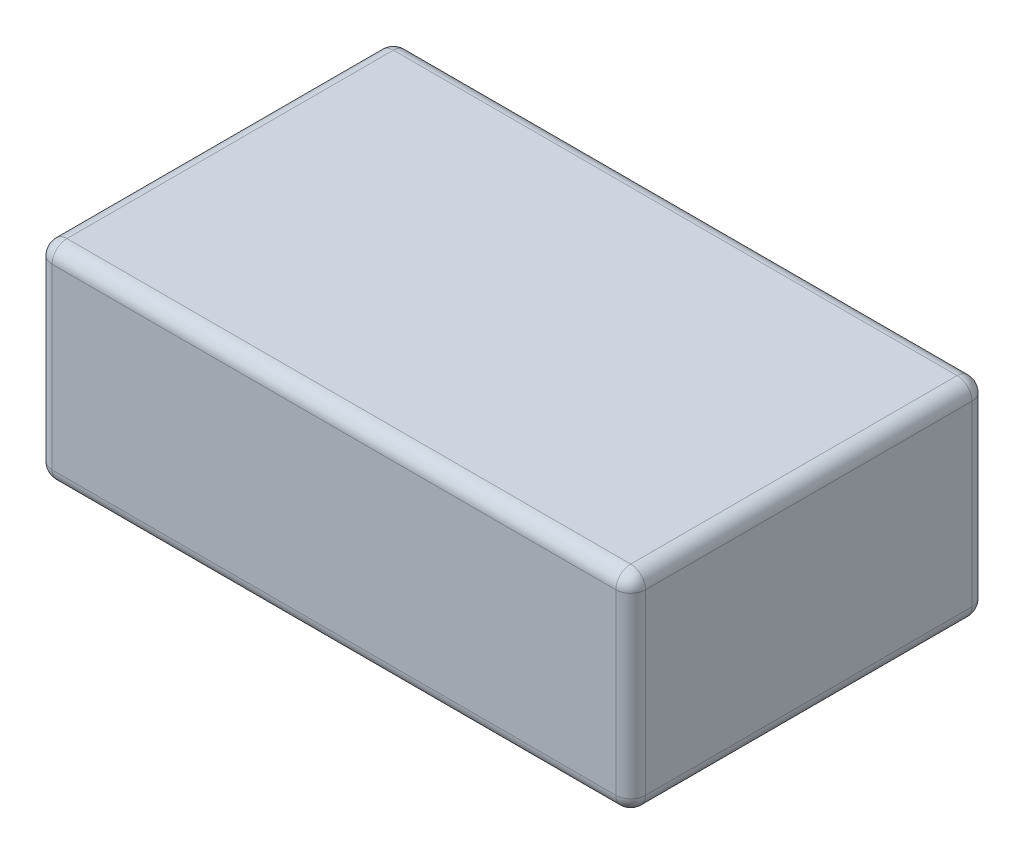
ISO-10303-21;
HEADER;
FILE_DESCRIPTION(('STEP AP214'),'2;1');
FILE_NAME('part.step','',(''),(''),'','','');
FILE_SCHEMA(('AUTOMOTIVE_DESIGN { 1 0 10303 214 1 1 1 1 }'));
ENDSEC;
DATA;
#1=APPLICATION_CONTEXT('core data for automotive mechanical design processes');
#2=APPLICATION_PROTOCOL_DEFINITION('international standard','automotive_design',2000,#1);
#3=PRODUCT_CONTEXT('',#1,'mechanical');
#4=PRODUCT('Part','Part','',(#3));
#5=PRODUCT_RELATED_PRODUCT_CATEGORY('part','',(#4));
#6=PRODUCT_DEFINITION_FORMATION('','',#4);
#7=PRODUCT_DEFINITION_CONTEXT('part definition',#1,'design');
#8=PRODUCT_DEFINITION('design','',#6,#7);
#9=PRODUCT_DEFINITION_SHAPE('','',#8);
#10=(LENGTH_UNIT() NAMED_UNIT(*) SI_UNIT(.MILLI.,.METRE.));
#11=(NAMED_UNIT(*) PLANE_ANGLE_UNIT() SI_UNIT($,.RADIAN.));
#12=(NAMED_UNIT(*) SI_UNIT($,.STERADIAN.) SOLID_ANGLE_UNIT());
#13=UNCERTAINTY_MEASURE_WITH_UNIT(LENGTH_MEASURE(1.E-05),#10,'distance_accuracy_value','');
#14=(GEOMETRIC_REPRESENTATION_CONTEXT(3) GLOBAL_UNCERTAINTY_ASSIGNED_CONTEXT((#13)) GLOBAL_UNIT_ASSIGNED_CONTEXT((#10,
#11,#12)) REPRESENTATION_CONTEXT('',''));
#15=CARTESIAN_POINT('',(0.,0.,0.));
#16=DIRECTION('',(0.,0.,1.));
#17=DIRECTION('',(1.,0.,0.));
#18=AXIS2_PLACEMENT_3D('',#15,#16,#17);
#19=CARTESIAN_POINT('',(0.95,0.05,0.55));
#20=DIRECTION('',(1.,0.,0.));
#21=DIRECTION('',(0.,0.,-1.));
#22=AXIS2_PLACEMENT_3D('',#19,#20,#21);
#23=SPHERICAL_SURFACE('',#22,0.05);
#24=CARTESIAN_POINT('',(0.95,0.05,0.55));
#25=DIRECTION('',(-1.,0.,0.));
#26=DIRECTION('',(0.,0.,1.));
#27=AXIS2_PLACEMENT_3D('',#24,#25,#26);
#28=CIRCLE('',#27,0.05);
#29=CARTESIAN_POINT('',(0.95,0.,0.55));
#30=VERTEX_POINT('',#29);
#31=CARTESIAN_POINT('',(0.95,0.049999999999988,0.6));
#32=VERTEX_POINT('',#31);
#33=EDGE_CURVE('E111',#30,#32,#28,.T.);
#34=ORIENTED_EDGE('',*,*,#33,.F.);
#35=CARTESIAN_POINT('',(0.95,0.05,0.55));
#36=DIRECTION('',(0.,0.,1.));
#37=DIRECTION('',(1.,0.,0.));
#38=AXIS2_PLACEMENT_3D('',#35,#36,#37);
#39=CIRCLE('',#38,0.05);
#40=CARTESIAN_POINT('',(1.,0.05,0.55));
#41=VERTEX_POINT('',#40);
#42=EDGE_CURVE('E122',#41,#30,#39,.F.);
#43=ORIENTED_EDGE('',*,*,#42,.F.);
#44=CARTESIAN_POINT('',(0.95,0.05,0.55));
#45=DIRECTION('',(0.,-1.,0.));
#46=DIRECTION('',(0.,0.,-1.));
#47=AXIS2_PLACEMENT_3D('',#44,#45,#46);
#48=CIRCLE('',#47,0.05);
#49=EDGE_CURVE('E131',#32,#41,#48,.F.);
#50=ORIENTED_EDGE('',*,*,#49,.F.);
#51=EDGE_LOOP('',(#34,#43,#50));
#52=FACE_BOUND('',#51,.T.);
#53=ADVANCED_FACE('F17',(#52),#23,.T.);
#54=CARTESIAN_POINT('',(-0.95,0.05,0.55));
#55=DIRECTION('',(1.,0.,0.));
#56=DIRECTION('',(0.,0.,-1.));
#57=AXIS2_PLACEMENT_3D('',#54,#55,#56);
#58=SPHERICAL_SURFACE('',#57,0.05);
#59=CARTESIAN_POINT('',(-0.95,0.05,0.55));
#60=DIRECTION('',(0.,-1.,0.));
#61=DIRECTION('',(0.,0.,-1.));
#62=AXIS2_PLACEMENT_3D('',#59,#60,#61);
#63=CIRCLE('',#62,0.05);
#64=CARTESIAN_POINT('',(-1.,0.05,0.55));
#65=VERTEX_POINT('',#64);
#66=CARTESIAN_POINT('',(-0.95,0.05,0.6));
#67=VERTEX_POINT('',#66);
#68=EDGE_CURVE('E261',#65,#67,#63,.F.);
#69=ORIENTED_EDGE('',*,*,#68,.F.);
#70=CARTESIAN_POINT('',(-0.95,0.05,0.55));
#71=DIRECTION('',(0.,0.,-1.));
#72=DIRECTION('',(-1.,0.,0.));
#73=AXIS2_PLACEMENT_3D('',#70,#71,#72);
#74=CIRCLE('',#73,0.05);
#75=CARTESIAN_POINT('',(-0.95,0.,0.549999999999904));
#76=VERTEX_POINT('',#75);
#77=EDGE_CURVE('E270',#76,#65,#74,.T.);
#78=ORIENTED_EDGE('',*,*,#77,.F.);
#79=CARTESIAN_POINT('',(-0.95,0.05,0.55));
#80=DIRECTION('',(-1.,0.,0.));
#81=DIRECTION('',(0.,0.,1.));
#82=AXIS2_PLACEMENT_3D('',#79,#80,#81);
#83=CIRCLE('',#82,0.05);
#84=EDGE_CURVE('E114',#67,#76,#83,.F.);
#85=ORIENTED_EDGE('',*,*,#84,.F.);
#86=EDGE_LOOP('',(#69,#78,#85));
#87=FACE_BOUND('',#86,.T.);
#88=ADVANCED_FACE('F151',(#87),#58,.T.);
#89=CARTESIAN_POINT('',(-0.95,0.05,-0.55));
#90=DIRECTION('',(1.,0.,0.));
#91=DIRECTION('',(0.,0.,-1.));
#92=AXIS2_PLACEMENT_3D('',#89,#90,#91);
#93=SPHERICAL_SURFACE('',#92,0.05);
#94=CARTESIAN_POINT('',(-0.95,0.05,-0.55));
#95=DIRECTION('',(0.,-1.,0.));
#96=DIRECTION('',(0.,0.,-1.));
#97=AXIS2_PLACEMENT_3D('',#94,#95,#96);
#98=CIRCLE('',#97,0.05);
#99=CARTESIAN_POINT('',(-0.95,0.05,-0.6));
#100=VERTEX_POINT('',#99);
#101=CARTESIAN_POINT('',(-1.,0.05,-0.55));
#102=VERTEX_POINT('',#101);
#103=EDGE_CURVE('E256',#100,#102,#98,.F.);
#104=ORIENTED_EDGE('',*,*,#103,.F.);
#105=CARTESIAN_POINT('',(-0.95,0.05,-0.55));
#106=DIRECTION('',(1.,0.,0.));
#107=DIRECTION('',(0.,0.,-1.));
#108=AXIS2_PLACEMENT_3D('',#105,#106,#107);
#109=CIRCLE('',#108,0.05);
#110=CARTESIAN_POINT('',(-0.95,0.,-0.55));
#111=VERTEX_POINT('',#110);
#112=EDGE_CURVE('E253',#111,#100,#109,.T.);
#113=ORIENTED_EDGE('',*,*,#112,.F.);
#114=CARTESIAN_POINT('',(-0.95,0.05,-0.55));
#115=DIRECTION('',(0.,0.,-1.));
#116=DIRECTION('',(-1.,0.,0.));
#117=AXIS2_PLACEMENT_3D('',#114,#115,#116);
#118=CIRCLE('',#117,0.05);
#119=EDGE_CURVE('E267',#102,#111,#118,.F.);
#120=ORIENTED_EDGE('',*,*,#119,.F.);
#121=EDGE_LOOP('',(#104,#113,#120));
#122=FACE_BOUND('',#121,.T.);
#123=ADVANCED_FACE('F147',(#122),#93,.T.);
#124=CARTESIAN_POINT('',(0.95,0.05,-0.55));
#125=DIRECTION('',(1.,0.,0.));
#126=DIRECTION('',(0.,0.,-1.));
#127=AXIS2_PLACEMENT_3D('',#124,#125,#126);
#128=SPHERICAL_SURFACE('',#127,0.05);
#129=CARTESIAN_POINT('',(0.95,0.05,-0.55));
#130=DIRECTION('',(1.,0.,0.));
#131=DIRECTION('',(0.,0.,-1.));
#132=AXIS2_PLACEMENT_3D('',#129,#130,#131);
#133=CIRCLE('',#132,0.05);
#134=CARTESIAN_POINT('',(0.95,0.05,-0.6));
#135=VERTEX_POINT('',#134);
#136=CARTESIAN_POINT('',(0.95,0.,-0.549999999999952));
#137=VERTEX_POINT('',#136);
#138=EDGE_CURVE('E251',#135,#137,#133,.F.);
#139=ORIENTED_EDGE('',*,*,#138,.F.);
#140=CARTESIAN_POINT('',(0.95,0.05,-0.55));
#141=DIRECTION('',(0.,-1.,0.));
#142=DIRECTION('',(0.,0.,-1.));
#143=AXIS2_PLACEMENT_3D('',#140,#141,#142);
#144=CIRCLE('',#143,0.05);
#145=CARTESIAN_POINT('',(1.,0.05,-0.55));
#146=VERTEX_POINT('',#145);
#147=EDGE_CURVE('E258',#146,#135,#144,.F.);
#148=ORIENTED_EDGE('',*,*,#147,.F.);
#149=CARTESIAN_POINT('',(0.95,0.05,-0.55));
#150=DIRECTION('',(0.,0.,1.));
#151=DIRECTION('',(1.,0.,0.));
#152=AXIS2_PLACEMENT_3D('',#149,#150,#151);
#153=CIRCLE('',#152,0.05);
#154=EDGE_CURVE('E133',#137,#146,#153,.T.);
#155=ORIENTED_EDGE('',*,*,#154,.F.);
#156=EDGE_LOOP('',(#139,#148,#155));
#157=FACE_BOUND('',#156,.T.);
#158=ADVANCED_FACE('F143',(#157),#128,.T.);
#159=CARTESIAN_POINT('',(0.95,0.05,0.6));
#160=DIRECTION('',(0.,0.,1.));
#161=DIRECTION('',(1.,0.,0.));
#162=AXIS2_PLACEMENT_3D('',#159,#160,#161);
#163=CYLINDRICAL_SURFACE('',#162,0.05);
#164=ORIENTED_EDGE('',*,*,#154,.T.);
#165=DIRECTION('',(0.,0.,1.));
#166=VECTOR('',#165,1.);
#167=CARTESIAN_POINT('',(1.,0.05,0.6));
#168=LINE('',#167,#166);
#169=EDGE_CURVE('E127',#146,#41,#168,.T.);
#170=ORIENTED_EDGE('',*,*,#169,.T.);
#171=ORIENTED_EDGE('',*,*,#42,.T.);
#172=DIRECTION('',(0.,0.,1.));
#173=VECTOR('',#172,1.);
#174=CARTESIAN_POINT('',(0.95,0.,0.6));
#175=LINE('',#174,#173);
#176=EDGE_CURVE('E124',#30,#137,#175,.F.);
#177=ORIENTED_EDGE('',*,*,#176,.T.);
#178=EDGE_LOOP('',(#164,#170,#171,#177));
#179=FACE_BOUND('',#178,.T.);
#180=ADVANCED_FACE('F123',(#179),#163,.T.);
#181=CARTESIAN_POINT('',(0.95,0.7,0.55));
#182=DIRECTION('',(0.,-1.,0.));
#183=DIRECTION('',(0.,0.,-1.));
#184=AXIS2_PLACEMENT_3D('',#181,#182,#183);
#185=CYLINDRICAL_SURFACE('',#184,0.05);
#186=ORIENTED_EDGE('',*,*,#49,.T.);
#187=DIRECTION('',(0.,1.,0.));
#188=VECTOR('',#187,1.);
#189=CARTESIAN_POINT('',(1.,0.7,0.55));
#190=LINE('',#189,#188);
#191=CARTESIAN_POINT('',(1.,0.65,0.55));
#192=VERTEX_POINT('',#191);
#193=EDGE_CURVE('E247',#41,#192,#190,.T.);
#194=ORIENTED_EDGE('',*,*,#193,.T.);
#195=CARTESIAN_POINT('',(0.95,0.65,0.55));
#196=DIRECTION('',(0.,-1.,0.));
#197=DIRECTION('',(1.,0.,0.));
#198=AXIS2_PLACEMENT_3D('',#195,#196,#197);
#199=CIRCLE('',#198,0.05);
#200=CARTESIAN_POINT('',(0.95,0.65,0.6));
#201=VERTEX_POINT('',#200);
#202=EDGE_CURVE('E242',#201,#192,#199,.F.);
#203=ORIENTED_EDGE('',*,*,#202,.F.);
#204=DIRECTION('',(0.,1.,0.));
#205=VECTOR('',#204,1.);
#206=CARTESIAN_POINT('',(0.95,0.7,0.6));
#207=LINE('',#206,#205);
#208=EDGE_CURVE('E116',#201,#32,#207,.F.);
#209=ORIENTED_EDGE('',*,*,#208,.T.);
#210=EDGE_LOOP('',(#186,#194,#203,#209));
#211=FACE_BOUND('',#210,.T.);
#212=ADVANCED_FACE('F274',(#211),#185,.T.);
#213=CARTESIAN_POINT('',(-0.95,0.05,0.6));
#214=DIRECTION('',(0.,0.,-1.));
#215=DIRECTION('',(-1.,0.,0.));
#216=AXIS2_PLACEMENT_3D('',#213,#214,#215);
#217=CYLINDRICAL_SURFACE('',#216,0.05);
#218=ORIENTED_EDGE('',*,*,#119,.T.);
#219=DIRECTION('',(0.,0.,-1.));
#220=VECTOR('',#219,1.);
#221=CARTESIAN_POINT('',(-0.95,0.,0.6));
#222=LINE('',#221,#220);
#223=EDGE_CURVE('E264',#111,#76,#222,.F.);
#224=ORIENTED_EDGE('',*,*,#223,.T.);
#225=ORIENTED_EDGE('',*,*,#77,.T.);
#226=DIRECTION('',(0.,0.,-1.));
#227=VECTOR('',#226,1.);
#228=CARTESIAN_POINT('',(-1.,0.05,0.6));
#229=LINE('',#228,#227);
#230=EDGE_CURVE('E220',#65,#102,#229,.T.);
#231=ORIENTED_EDGE('',*,*,#230,.T.);
#232=EDGE_LOOP('',(#218,#224,#225,#231));
#233=FACE_BOUND('',#232,.T.);
#234=ADVANCED_FACE('F361',(#233),#217,.T.);
#235=CARTESIAN_POINT('',(-0.95,0.7,0.55));
#236=DIRECTION('',(0.,-1.,0.));
#237=DIRECTION('',(0.,0.,-1.));
#238=AXIS2_PLACEMENT_3D('',#235,#236,#237);
#239=CYLINDRICAL_SURFACE('',#238,0.05);
#240=ORIENTED_EDGE('',*,*,#68,.T.);
#241=DIRECTION('',(0.,1.,0.));
#242=VECTOR('',#241,1.);
#243=CARTESIAN_POINT('',(-0.95,0.7,0.6));
#244=LINE('',#243,#242);
#245=CARTESIAN_POINT('',(-0.95,0.649999999999952,0.6));
#246=VERTEX_POINT('',#245);
#247=EDGE_CURVE('E241',#67,#246,#244,.T.);
#248=ORIENTED_EDGE('',*,*,#247,.T.);
#249=CARTESIAN_POINT('',(-0.95,0.65,0.55));
#250=DIRECTION('',(0.,-1.,-7.66574547575187E-12));
#251=DIRECTION('',(1.,0.,0.));
#252=AXIS2_PLACEMENT_3D('',#249,#250,#251);
#253=CIRCLE('',#252,0.05);
#254=CARTESIAN_POINT('',(-1.,0.65,0.55));
#255=VERTEX_POINT('',#254);
#256=EDGE_CURVE('E223',#255,#246,#253,.F.);
#257=ORIENTED_EDGE('',*,*,#256,.F.);
#258=DIRECTION('',(0.,1.,0.));
#259=VECTOR('',#258,1.);
#260=CARTESIAN_POINT('',(-1.,0.7,0.55));
#261=LINE('',#260,#259);
#262=EDGE_CURVE('E214',#255,#65,#261,.F.);
#263=ORIENTED_EDGE('',*,*,#262,.T.);
#264=EDGE_LOOP('',(#240,#248,#257,#263));
#265=FACE_BOUND('',#264,.T.);
#266=ADVANCED_FACE('F359',(#265),#239,.T.);
#267=CARTESIAN_POINT('',(0.95,0.7,-0.55));
#268=DIRECTION('',(0.,-1.,0.));
#269=DIRECTION('',(0.,0.,-1.));
#270=AXIS2_PLACEMENT_3D('',#267,#268,#269);
#271=CYLINDRICAL_SURFACE('',#270,0.05);
#272=ORIENTED_EDGE('',*,*,#147,.T.);
#273=DIRECTION('',(0.,1.,0.));
#274=VECTOR('',#273,1.);
#275=CARTESIAN_POINT('',(0.95,0.7,-0.6));
#276=LINE('',#275,#274);
#277=CARTESIAN_POINT('',(0.95,0.65,-0.6));
#278=VERTEX_POINT('',#277);
#279=EDGE_CURVE('E206',#135,#278,#276,.T.);
#280=ORIENTED_EDGE('',*,*,#279,.T.);
#281=CARTESIAN_POINT('',(0.95,0.65,-0.55));
#282=DIRECTION('',(0.,1.,0.));
#283=DIRECTION('',(1.,0.,0.));
#284=AXIS2_PLACEMENT_3D('',#281,#282,#283);
#285=CIRCLE('',#284,0.05);
#286=CARTESIAN_POINT('',(1.,0.65,-0.55));
#287=VERTEX_POINT('',#286);
#288=EDGE_CURVE('E208',#287,#278,#285,.T.);
#289=ORIENTED_EDGE('',*,*,#288,.F.);
#290=DIRECTION('',(0.,1.,0.));
#291=VECTOR('',#290,1.);
#292=CARTESIAN_POINT('',(1.,0.7,-0.55));
#293=LINE('',#292,#291);
#294=EDGE_CURVE('E117',#287,#146,#293,.F.);
#295=ORIENTED_EDGE('',*,*,#294,.T.);
#296=EDGE_LOOP('',(#272,#280,#289,#295));
#297=FACE_BOUND('',#296,.T.);
#298=ADVANCED_FACE('F310',(#297),#271,.T.);
#299=CARTESIAN_POINT('',(-0.95,0.7,-0.55));
#300=DIRECTION('',(0.,-1.,0.));
#301=DIRECTION('',(0.,0.,-1.));
#302=AXIS2_PLACEMENT_3D('',#299,#300,#301);
#303=CYLINDRICAL_SURFACE('',#302,0.05);
#304=CARTESIAN_POINT('',(-0.95,0.65,-0.55));
#305=DIRECTION('',(0.,1.,0.));
#306=DIRECTION('',(1.,0.,0.));
#307=AXIS2_PLACEMENT_3D('',#304,#305,#306);
#308=CIRCLE('',#307,0.05);
#309=CARTESIAN_POINT('',(-0.95,0.65,-0.6));
#310=VERTEX_POINT('',#309);
#311=CARTESIAN_POINT('',(-1.,0.65,-0.55));
#312=VERTEX_POINT('',#311);
#313=EDGE_CURVE('E210',#310,#312,#308,.T.);
#314=ORIENTED_EDGE('',*,*,#313,.F.);
#315=DIRECTION('',(0.,1.,0.));
#316=VECTOR('',#315,1.);
#317=CARTESIAN_POINT('',(-0.95,0.7,-0.6));
#318=LINE('',#317,#316);
#319=EDGE_CURVE('E300',#310,#100,#318,.F.);
#320=ORIENTED_EDGE('',*,*,#319,.T.);
#321=ORIENTED_EDGE('',*,*,#103,.T.);
#322=DIRECTION('',(0.,1.,0.));
#323=VECTOR('',#322,1.);
#324=CARTESIAN_POINT('',(-1.,0.7,-0.55));
#325=LINE('',#324,#323);
#326=EDGE_CURVE('E217',#102,#312,#325,.T.);
#327=ORIENTED_EDGE('',*,*,#326,.T.);
#328=EDGE_LOOP('',(#314,#320,#321,#327));
#329=FACE_BOUND('',#328,.T.);
#330=ADVANCED_FACE('F351',(#329),#303,.T.);
#331=CARTESIAN_POINT('',(1.,0.,-0.6));
#332=DIRECTION('',(0.,-1.,0.));
#333=DIRECTION('',(0.,0.,-1.));
#334=AXIS2_PLACEMENT_3D('',#331,#332,#333);
#335=PLANE('',#334);
#336=DIRECTION('',(1.,0.,0.));
#337=VECTOR('',#336,1.);
#338=CARTESIAN_POINT('',(-1.,0.,-0.55));
#339=LINE('',#338,#337);
#340=EDGE_CURVE('E101',#137,#111,#339,.F.);
#341=ORIENTED_EDGE('',*,*,#340,.F.);
#342=ORIENTED_EDGE('',*,*,#176,.F.);
#343=DIRECTION('',(-1.,0.,0.));
#344=VECTOR('',#343,1.);
#345=CARTESIAN_POINT('',(-1.,0.,0.55));
#346=LINE('',#345,#344);
#347=EDGE_CURVE('E107',#76,#30,#346,.F.);
#348=ORIENTED_EDGE('',*,*,#347,.F.);
#349=ORIENTED_EDGE('',*,*,#223,.F.);
#350=EDGE_LOOP('',(#341,#342,#348,#349));
#351=FACE_BOUND('',#350,.T.);
#352=ADVANCED_FACE('F135',(#351),#335,.T.);
#353=CARTESIAN_POINT('',(1.,0.7,0.6));
#354=DIRECTION('',(-1.,0.,0.));
#355=DIRECTION('',(0.,0.,1.));
#356=AXIS2_PLACEMENT_3D('',#353,#354,#355);
#357=PLANE('',#356);
#358=DIRECTION('',(0.,0.,-1.));
#359=VECTOR('',#358,1.);
#360=CARTESIAN_POINT('',(1.,0.65,-0.6));
#361=LINE('',#360,#359);
#362=EDGE_CURVE('E291',#192,#287,#361,.T.);
#363=ORIENTED_EDGE('',*,*,#362,.F.);
#364=ORIENTED_EDGE('',*,*,#193,.F.);
#365=ORIENTED_EDGE('',*,*,#169,.F.);
#366=ORIENTED_EDGE('',*,*,#294,.F.);
#367=EDGE_LOOP('',(#363,#364,#365,#366));
#368=FACE_BOUND('',#367,.T.);
#369=ADVANCED_FACE('F346',(#368),#357,.F.);
#370=CARTESIAN_POINT('',(-1.,0.05,0.55));
#371=DIRECTION('',(-1.,0.,0.));
#372=DIRECTION('',(0.,0.,1.));
#373=AXIS2_PLACEMENT_3D('',#370,#371,#372);
#374=CYLINDRICAL_SURFACE('',#373,0.05);
#375=ORIENTED_EDGE('',*,*,#347,.T.);
#376=ORIENTED_EDGE('',*,*,#33,.T.);
#377=DIRECTION('',(-1.,0.,0.));
#378=VECTOR('',#377,1.);
#379=CARTESIAN_POINT('',(-1.,0.05,0.6));
#380=LINE('',#379,#378);
#381=EDGE_CURVE('E282',#32,#67,#380,.T.);
#382=ORIENTED_EDGE('',*,*,#381,.T.);
#383=ORIENTED_EDGE('',*,*,#84,.T.);
#384=EDGE_LOOP('',(#375,#376,#382,#383));
#385=FACE_BOUND('',#384,.T.);
#386=ADVANCED_FACE('F109',(#385),#374,.T.);
#387=CARTESIAN_POINT('',(0.95,0.65,0.55));
#388=DIRECTION('',(1.,0.,0.));
#389=DIRECTION('',(0.,0.,-1.));
#390=AXIS2_PLACEMENT_3D('',#387,#388,#389);
#391=SPHERICAL_SURFACE('',#390,0.05);
#392=ORIENTED_EDGE('',*,*,#202,.T.);
#393=CARTESIAN_POINT('',(0.95,0.65,0.55));
#394=DIRECTION('',(0.,0.,-1.));
#395=DIRECTION('',(-1.,0.,0.));
#396=AXIS2_PLACEMENT_3D('',#393,#394,#395);
#397=CIRCLE('',#396,0.05);
#398=CARTESIAN_POINT('',(0.95,0.7,0.549999999999617));
#399=VERTEX_POINT('',#398);
#400=EDGE_CURVE('E297',#399,#192,#397,.T.);
#401=ORIENTED_EDGE('',*,*,#400,.F.);
#402=CARTESIAN_POINT('',(0.95,0.65,0.55));
#403=DIRECTION('',(1.,0.,0.));
#404=DIRECTION('',(0.,0.,-1.));
#405=AXIS2_PLACEMENT_3D('',#402,#403,#404);
#406=CIRCLE('',#405,0.05);
#407=EDGE_CURVE('E284',#201,#399,#406,.F.);
#408=ORIENTED_EDGE('',*,*,#407,.F.);
#409=EDGE_LOOP('',(#392,#401,#408));
#410=FACE_BOUND('',#409,.T.);
#411=ADVANCED_FACE('F232',(#410),#391,.T.);
#412=CARTESIAN_POINT('',(-0.95,0.65,0.55));
#413=DIRECTION('',(1.,0.,0.));
#414=DIRECTION('',(0.,0.,-1.));
#415=AXIS2_PLACEMENT_3D('',#412,#413,#414);
#416=SPHERICAL_SURFACE('',#415,0.05);
#417=ORIENTED_EDGE('',*,*,#256,.T.);
#418=CARTESIAN_POINT('',(-0.95,0.65,0.55));
#419=DIRECTION('',(1.,0.,0.));
#420=DIRECTION('',(0.,0.,-1.));
#421=AXIS2_PLACEMENT_3D('',#418,#419,#420);
#422=CIRCLE('',#421,0.05);
#423=CARTESIAN_POINT('',(-0.95,0.7,0.55));
#424=VERTEX_POINT('',#423);
#425=EDGE_CURVE('E288',#424,#246,#422,.T.);
#426=ORIENTED_EDGE('',*,*,#425,.F.);
#427=CARTESIAN_POINT('',(-0.95,0.65,0.55));
#428=DIRECTION('',(0.,0.,1.));
#429=DIRECTION('',(1.,0.,0.));
#430=AXIS2_PLACEMENT_3D('',#427,#428,#429);
#431=CIRCLE('',#430,0.05);
#432=EDGE_CURVE('E331',#255,#424,#431,.F.);
#433=ORIENTED_EDGE('',*,*,#432,.F.);
#434=EDGE_LOOP('',(#417,#426,#433));
#435=FACE_BOUND('',#434,.T.);
#436=ADVANCED_FACE('F228',(#435),#416,.T.);
#437=CARTESIAN_POINT('',(-1.,0.7,0.6));
#438=DIRECTION('',(1.,0.,0.));
#439=DIRECTION('',(0.,0.,-1.));
#440=AXIS2_PLACEMENT_3D('',#437,#438,#439);
#441=PLANE('',#440);
#442=DIRECTION('',(0.,0.,1.));
#443=VECTOR('',#442,1.);
#444=CARTESIAN_POINT('',(-1.,0.65,-0.6));
#445=LINE('',#444,#443);
#446=EDGE_CURVE('E322',#312,#255,#445,.T.);
#447=ORIENTED_EDGE('',*,*,#446,.F.);
#448=ORIENTED_EDGE('',*,*,#326,.F.);
#449=ORIENTED_EDGE('',*,*,#230,.F.);
#450=ORIENTED_EDGE('',*,*,#262,.F.);
#451=EDGE_LOOP('',(#447,#448,#449,#450));
#452=FACE_BOUND('',#451,.T.);
#453=ADVANCED_FACE('F231',(#452),#441,.F.);
#454=CARTESIAN_POINT('',(-0.95,0.65,-0.55));
#455=DIRECTION('',(1.,0.,0.));
#456=DIRECTION('',(0.,0.,-1.));
#457=AXIS2_PLACEMENT_3D('',#454,#455,#456);
#458=SPHERICAL_SURFACE('',#457,0.05);
#459=CARTESIAN_POINT('',(-0.95,0.65,-0.55));
#460=DIRECTION('',(0.,0.,1.));
#461=DIRECTION('',(1.,0.,0.));
#462=AXIS2_PLACEMENT_3D('',#459,#460,#461);
#463=CIRCLE('',#462,0.05);
#464=CARTESIAN_POINT('',(-0.95,0.7,-0.549999999999617));
#465=VERTEX_POINT('',#464);
#466=EDGE_CURVE('E328',#465,#312,#463,.T.);
#467=ORIENTED_EDGE('',*,*,#466,.F.);
#468=CARTESIAN_POINT('',(-0.95,0.65,-0.55));
#469=DIRECTION('',(-1.,0.,0.));
#470=DIRECTION('',(0.,0.,1.));
#471=AXIS2_PLACEMENT_3D('',#468,#469,#470);
#472=CIRCLE('',#471,0.05);
#473=EDGE_CURVE('E318',#310,#465,#472,.F.);
#474=ORIENTED_EDGE('',*,*,#473,.F.);
#475=ORIENTED_EDGE('',*,*,#313,.T.);
#476=EDGE_LOOP('',(#467,#474,#475));
#477=FACE_BOUND('',#476,.T.);
#478=ADVANCED_FACE('F199',(#477),#458,.T.);
#479=CARTESIAN_POINT('',(0.95,0.65,-0.55));
#480=DIRECTION('',(1.,0.,0.));
#481=DIRECTION('',(0.,0.,-1.));
#482=AXIS2_PLACEMENT_3D('',#479,#480,#481);
#483=SPHERICAL_SURFACE('',#482,0.05);
#484=CARTESIAN_POINT('',(0.95,0.65,-0.55));
#485=DIRECTION('',(0.,0.,-1.));
#486=DIRECTION('',(-1.,0.,0.));
#487=AXIS2_PLACEMENT_3D('',#484,#485,#486);
#488=CIRCLE('',#487,0.05);
#489=CARTESIAN_POINT('',(0.95,0.7,-0.55));
#490=VERTEX_POINT('',#489);
#491=EDGE_CURVE('E285',#287,#490,#488,.F.);
#492=ORIENTED_EDGE('',*,*,#491,.F.);
#493=ORIENTED_EDGE('',*,*,#288,.T.);
#494=CARTESIAN_POINT('',(0.95,0.65,-0.55));
#495=DIRECTION('',(-1.,0.,0.));
#496=DIRECTION('',(0.,0.,1.));
#497=AXIS2_PLACEMENT_3D('',#494,#495,#496);
#498=CIRCLE('',#497,0.05);
#499=EDGE_CURVE('E315',#490,#278,#498,.T.);
#500=ORIENTED_EDGE('',*,*,#499,.F.);
#501=EDGE_LOOP('',(#492,#493,#500));
#502=FACE_BOUND('',#501,.T.);
#503=ADVANCED_FACE('F194',(#502),#483,.T.);
#504=CARTESIAN_POINT('',(-1.,0.05,-0.55));
#505=DIRECTION('',(1.,0.,0.));
#506=DIRECTION('',(0.,0.,-1.));
#507=AXIS2_PLACEMENT_3D('',#504,#505,#506);
#508=CYLINDRICAL_SURFACE('',#507,0.05);
#509=DIRECTION('',(1.,0.,0.));
#510=VECTOR('',#509,1.);
#511=CARTESIAN_POINT('',(-1.,0.05,-0.6));
#512=LINE('',#511,#510);
#513=EDGE_CURVE('E317',#100,#135,#512,.T.);
#514=ORIENTED_EDGE('',*,*,#513,.T.);
#515=ORIENTED_EDGE('',*,*,#138,.T.);
#516=ORIENTED_EDGE('',*,*,#340,.T.);
#517=ORIENTED_EDGE('',*,*,#112,.T.);
#518=EDGE_LOOP('',(#514,#515,#516,#517));
#519=FACE_BOUND('',#518,.T.);
#520=ADVANCED_FACE('F190',(#519),#508,.T.);
#521=CARTESIAN_POINT('',(0.95,0.65,-0.6));
#522=DIRECTION('',(0.,0.,-1.));
#523=DIRECTION('',(-1.,0.,0.));
#524=AXIS2_PLACEMENT_3D('',#521,#522,#523);
#525=CYLINDRICAL_SURFACE('',#524,0.05);
#526=ORIENTED_EDGE('',*,*,#491,.T.);
#527=DIRECTION('',(0.,0.,-1.));
#528=VECTOR('',#527,1.);
#529=CARTESIAN_POINT('',(0.95,0.7,-0.6));
#530=LINE('',#529,#528);
#531=EDGE_CURVE('E320',#490,#399,#530,.F.);
#532=ORIENTED_EDGE('',*,*,#531,.T.);
#533=ORIENTED_EDGE('',*,*,#400,.T.);
#534=ORIENTED_EDGE('',*,*,#362,.T.);
#535=EDGE_LOOP('',(#526,#532,#533,#534));
#536=FACE_BOUND('',#535,.T.);
#537=ADVANCED_FACE('F186',(#536),#525,.T.);
#538=CARTESIAN_POINT('',(-1.,0.7,0.6));
#539=DIRECTION('',(0.,0.,-1.));
#540=DIRECTION('',(-1.,0.,0.));
#541=AXIS2_PLACEMENT_3D('',#538,#539,#540);
#542=PLANE('',#541);
#543=DIRECTION('',(1.,0.,0.));
#544=VECTOR('',#543,1.);
#545=CARTESIAN_POINT('',(1.,0.65,0.6));
#546=LINE('',#545,#544);
#547=EDGE_CURVE('E280',#246,#201,#546,.T.);
#548=ORIENTED_EDGE('',*,*,#547,.F.);
#549=ORIENTED_EDGE('',*,*,#247,.F.);
#550=ORIENTED_EDGE('',*,*,#381,.F.);
#551=ORIENTED_EDGE('',*,*,#208,.F.);
#552=EDGE_LOOP('',(#548,#549,#550,#551));
#553=FACE_BOUND('',#552,.T.);
#554=ADVANCED_FACE('F182',(#553),#542,.F.);
#555=CARTESIAN_POINT('',(-0.95,0.65,-0.6));
#556=DIRECTION('',(0.,0.,1.));
#557=DIRECTION('',(1.,0.,0.));
#558=AXIS2_PLACEMENT_3D('',#555,#556,#557);
#559=CYLINDRICAL_SURFACE('',#558,0.05);
#560=ORIENTED_EDGE('',*,*,#466,.T.);
#561=ORIENTED_EDGE('',*,*,#446,.T.);
#562=ORIENTED_EDGE('',*,*,#432,.T.);
#563=DIRECTION('',(0.,0.,-1.));
#564=VECTOR('',#563,1.);
#565=CARTESIAN_POINT('',(-0.95,0.7,-0.6));
#566=LINE('',#565,#564);
#567=EDGE_CURVE('E338',#424,#465,#566,.T.);
#568=ORIENTED_EDGE('',*,*,#567,.T.);
#569=EDGE_LOOP('',(#560,#561,#562,#568));
#570=FACE_BOUND('',#569,.T.);
#571=ADVANCED_FACE('F178',(#570),#559,.T.);
#572=CARTESIAN_POINT('',(-1.,0.7,-0.6));
#573=DIRECTION('',(0.,0.,1.));
#574=DIRECTION('',(1.,0.,0.));
#575=AXIS2_PLACEMENT_3D('',#572,#573,#574);
#576=PLANE('',#575);
#577=ORIENTED_EDGE('',*,*,#513,.F.);
#578=ORIENTED_EDGE('',*,*,#319,.F.);
#579=DIRECTION('',(-1.,0.,0.));
#580=VECTOR('',#579,1.);
#581=CARTESIAN_POINT('',(1.,0.65,-0.6));
#582=LINE('',#581,#580);
#583=EDGE_CURVE('E316',#278,#310,#582,.T.);
#584=ORIENTED_EDGE('',*,*,#583,.F.);
#585=ORIENTED_EDGE('',*,*,#279,.F.);
#586=EDGE_LOOP('',(#577,#578,#584,#585));
#587=FACE_BOUND('',#586,.T.);
#588=ADVANCED_FACE('F174',(#587),#576,.F.);
#589=CARTESIAN_POINT('',(1.,0.65,0.55));
#590=DIRECTION('',(1.,0.,0.));
#591=DIRECTION('',(0.,0.,-1.));
#592=AXIS2_PLACEMENT_3D('',#589,#590,#591);
#593=CYLINDRICAL_SURFACE('',#592,0.05);
#594=ORIENTED_EDGE('',*,*,#547,.T.);
#595=ORIENTED_EDGE('',*,*,#407,.T.);
#596=DIRECTION('',(1.,0.,0.));
#597=VECTOR('',#596,1.);
#598=CARTESIAN_POINT('',(1.,0.7,0.55));
#599=LINE('',#598,#597);
#600=EDGE_CURVE('E26',#399,#424,#599,.F.);
#601=ORIENTED_EDGE('',*,*,#600,.T.);
#602=ORIENTED_EDGE('',*,*,#425,.T.);
#603=EDGE_LOOP('',(#594,#595,#601,#602));
#604=FACE_BOUND('',#603,.T.);
#605=ADVANCED_FACE('F168',(#604),#593,.T.);
#606=CARTESIAN_POINT('',(1.,0.65,-0.55));
#607=DIRECTION('',(-1.,0.,0.));
#608=DIRECTION('',(0.,0.,1.));
#609=AXIS2_PLACEMENT_3D('',#606,#607,#608);
#610=CYLINDRICAL_SURFACE('',#609,0.05);
#611=DIRECTION('',(1.,0.,0.));
#612=VECTOR('',#611,1.);
#613=CARTESIAN_POINT('',(1.,0.7,-0.55));
#614=LINE('',#613,#612);
#615=EDGE_CURVE('E11',#465,#490,#614,.T.);
#616=ORIENTED_EDGE('',*,*,#615,.T.);
#617=ORIENTED_EDGE('',*,*,#499,.T.);
#618=ORIENTED_EDGE('',*,*,#583,.T.);
#619=ORIENTED_EDGE('',*,*,#473,.T.);
#620=EDGE_LOOP('',(#616,#617,#618,#619));
#621=FACE_BOUND('',#620,.T.);
#622=ADVANCED_FACE('F163',(#621),#610,.T.);
#623=CARTESIAN_POINT('',(1.,0.7,-0.6));
#624=DIRECTION('',(0.,-1.,0.));
#625=DIRECTION('',(0.,0.,-1.));
#626=AXIS2_PLACEMENT_3D('',#623,#624,#625);
#627=PLANE('',#626);
#628=ORIENTED_EDGE('',*,*,#615,.F.);
#629=ORIENTED_EDGE('',*,*,#567,.F.);
#630=ORIENTED_EDGE('',*,*,#600,.F.);
#631=ORIENTED_EDGE('',*,*,#531,.F.);
#632=EDGE_LOOP('',(#628,#629,#630,#631));
#633=FACE_BOUND('',#632,.T.);
#634=ADVANCED_FACE('F161',(#633),#627,.F.);
#635=CLOSED_SHELL('',(#53,#88,#123,#158,#180,#212,#234,#266,#298,#330,#352,#369,#386,#411,#436,
#453,#478,#503,#520,#537,#554,#571,#588,#605,#622,#634));
#636=MANIFOLD_SOLID_BREP('B1',#635);
#637=ADVANCED_BREP_SHAPE_REPRESENTATION('',(#18,#636),#14);
#638=SHAPE_DEFINITION_REPRESENTATION(#9,#637);
ENDSEC;
END-ISO-10303-21;
